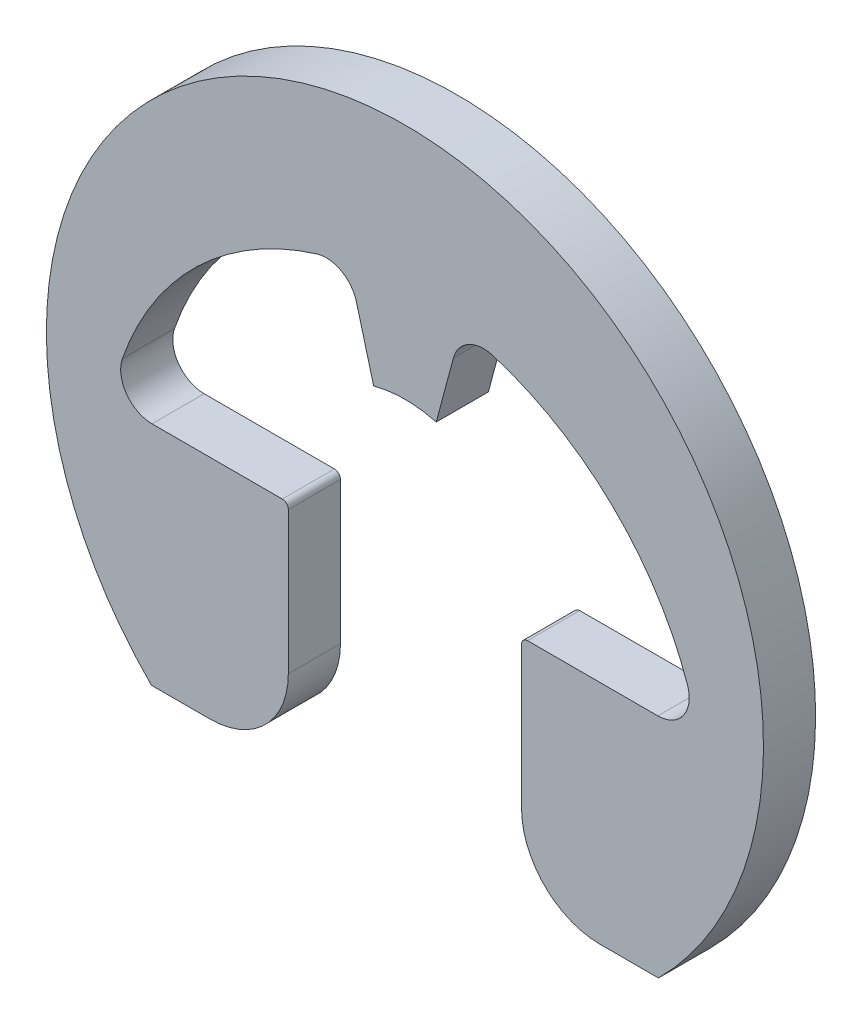
ISO-10303-21;
HEADER;
FILE_DESCRIPTION(('STEP AP214'),'2;1');
FILE_NAME('part.step','',(''),(''),'','','');
FILE_SCHEMA(('AUTOMOTIVE_DESIGN { 1 0 10303 214 1 1 1 1 }'));
ENDSEC;
DATA;
#1=APPLICATION_CONTEXT('core data for automotive mechanical design processes');
#2=APPLICATION_PROTOCOL_DEFINITION('international standard','automotive_design',2000,#1);
#3=PRODUCT_CONTEXT('',#1,'mechanical');
#4=PRODUCT('Part','Part','',(#3));
#5=PRODUCT_RELATED_PRODUCT_CATEGORY('part','',(#4));
#6=PRODUCT_DEFINITION_FORMATION('','',#4);
#7=PRODUCT_DEFINITION_CONTEXT('part definition',#1,'design');
#8=PRODUCT_DEFINITION('design','',#6,#7);
#9=PRODUCT_DEFINITION_SHAPE('','',#8);
#10=(LENGTH_UNIT() NAMED_UNIT(*) SI_UNIT(.MILLI.,.METRE.));
#11=(NAMED_UNIT(*) PLANE_ANGLE_UNIT() SI_UNIT($,.RADIAN.));
#12=(NAMED_UNIT(*) SI_UNIT($,.STERADIAN.) SOLID_ANGLE_UNIT());
#13=UNCERTAINTY_MEASURE_WITH_UNIT(LENGTH_MEASURE(1.E-05),#10,'distance_accuracy_value','');
#14=(GEOMETRIC_REPRESENTATION_CONTEXT(3) GLOBAL_UNCERTAINTY_ASSIGNED_CONTEXT((#13)) GLOBAL_UNIT_ASSIGNED_CONTEXT((#10,
#11,#12)) REPRESENTATION_CONTEXT('',''));
#15=CARTESIAN_POINT('',(0.,0.,0.));
#16=DIRECTION('',(0.,0.,1.));
#17=DIRECTION('',(1.,0.,0.));
#18=AXIS2_PLACEMENT_3D('',#15,#16,#17);
#19=CARTESIAN_POINT('',(-3.08091253639806,0.0553443471143975,-0.635));
#20=DIRECTION('',(0.,0.,1.));
#21=DIRECTION('',(1.,0.,0.));
#22=AXIS2_PLACEMENT_3D('',#19,#20,#21);
#23=CYLINDRICAL_SURFACE('',#22,0.382041175221683);
#24=CARTESIAN_POINT('',(-3.08091253639806,0.0553443471143975,0.));
#25=DIRECTION('',(0.,0.,-1.));
#26=DIRECTION('',(1.,0.,0.));
#27=AXIS2_PLACEMENT_3D('',#24,#25,#26);
#28=CIRCLE('',#27,0.382041175221683);
#29=CARTESIAN_POINT('',(-3.08091253639806,-0.326696828107286,0.));
#30=VERTEX_POINT('',#29);
#31=CARTESIAN_POINT('',(-3.44192060779963,0.180358874061002,0.));
#32=VERTEX_POINT('',#31);
#33=EDGE_CURVE('E208',#30,#32,#28,.T.);
#34=ORIENTED_EDGE('',*,*,#33,.F.);
#35=DIRECTION('',(0.,0.,1.));
#36=VECTOR('',#35,1.);
#37=CARTESIAN_POINT('',(-3.08091253639806,-0.326696828107286,-0.635));
#38=LINE('',#37,#36);
#39=CARTESIAN_POINT('',(-3.08091253639806,-0.326696828107286,-0.635));
#40=VERTEX_POINT('',#39);
#41=EDGE_CURVE('E11',#40,#30,#38,.T.);
#42=ORIENTED_EDGE('',*,*,#41,.F.);
#43=CARTESIAN_POINT('',(-3.08091253639806,0.0553443471143975,-0.635));
#44=DIRECTION('',(0.,0.,-1.));
#45=DIRECTION('',(1.,0.,0.));
#46=AXIS2_PLACEMENT_3D('',#43,#44,#45);
#47=CIRCLE('',#46,0.382041175221683);
#48=CARTESIAN_POINT('',(-3.44192060779963,0.180358874061002,-0.635));
#49=VERTEX_POINT('',#48);
#50=EDGE_CURVE('E264',#40,#49,#47,.T.);
#51=ORIENTED_EDGE('',*,*,#50,.T.);
#52=DIRECTION('',(0.,0.,1.));
#53=VECTOR('',#52,1.);
#54=CARTESIAN_POINT('',(-3.44192060779963,0.180358874061002,-0.635));
#55=LINE('',#54,#53);
#56=EDGE_CURVE('E42',#49,#32,#55,.T.);
#57=ORIENTED_EDGE('',*,*,#56,.T.);
#58=EDGE_LOOP('',(#34,#42,#51,#57));
#59=FACE_BOUND('',#58,.T.);
#60=ADVANCED_FACE('F39',(#59),#23,.F.);
#61=CARTESIAN_POINT('',(-1.49415202365351,-0.326696828107286,-0.635));
#62=DIRECTION('',(0.,1.,0.));
#63=DIRECTION('',(-1.,0.,0.));
#64=AXIS2_PLACEMENT_3D('',#61,#62,#63);
#65=PLANE('',#64);
#66=DIRECTION('',(-1.,0.,0.));
#67=VECTOR('',#66,1.);
#68=CARTESIAN_POINT('',(-1.49415202365351,-0.326696828107286,0.));
#69=LINE('',#68,#67);
#70=CARTESIAN_POINT('',(-1.49415202365351,-0.326696828107286,0.));
#71=VERTEX_POINT('',#70);
#72=EDGE_CURVE('E262',#71,#30,#69,.T.);
#73=ORIENTED_EDGE('',*,*,#72,.F.);
#74=DIRECTION('',(0.,0.,1.));
#75=VECTOR('',#74,1.);
#76=CARTESIAN_POINT('',(-1.49415202365351,-0.326696828107286,-0.635));
#77=LINE('',#76,#75);
#78=CARTESIAN_POINT('',(-1.49415202365351,-0.326696828107286,-0.635));
#79=VERTEX_POINT('',#78);
#80=EDGE_CURVE('E48',#79,#71,#77,.T.);
#81=ORIENTED_EDGE('',*,*,#80,.F.);
#82=DIRECTION('',(-1.,0.,0.));
#83=VECTOR('',#82,1.);
#84=CARTESIAN_POINT('',(-1.49415202365351,-0.326696828107286,-0.635));
#85=LINE('',#84,#83);
#86=EDGE_CURVE('E198',#79,#40,#85,.T.);
#87=ORIENTED_EDGE('',*,*,#86,.T.);
#88=ORIENTED_EDGE('',*,*,#41,.T.);
#89=EDGE_LOOP('',(#73,#81,#87,#88));
#90=FACE_BOUND('',#89,.T.);
#91=ADVANCED_FACE('F300',(#90),#65,.T.);
#92=CARTESIAN_POINT('',(-1.49415202365351,-0.400356828107286,-0.635));
#93=DIRECTION('',(0.,0.,1.));
#94=DIRECTION('',(1.,0.,0.));
#95=AXIS2_PLACEMENT_3D('',#92,#93,#94);
#96=CYLINDRICAL_SURFACE('',#95,0.07366);
#97=CARTESIAN_POINT('',(-1.49415202365351,-0.400356828107286,0.));
#98=DIRECTION('',(0.,0.,1.));
#99=DIRECTION('',(1.,0.,0.));
#100=AXIS2_PLACEMENT_3D('',#97,#98,#99);
#101=CIRCLE('',#100,0.07366);
#102=CARTESIAN_POINT('',(-1.42049202365351,-0.400356828107286,0.));
#103=VERTEX_POINT('',#102);
#104=EDGE_CURVE('E185',#103,#71,#101,.T.);
#105=ORIENTED_EDGE('',*,*,#104,.F.);
#106=DIRECTION('',(0.,0.,1.));
#107=VECTOR('',#106,1.);
#108=CARTESIAN_POINT('',(-1.42049202365351,-0.400356828107286,-0.635));
#109=LINE('',#108,#107);
#110=CARTESIAN_POINT('',(-1.42049202365351,-0.400356828107286,-0.635));
#111=VERTEX_POINT('',#110);
#112=EDGE_CURVE('E180',#111,#103,#109,.T.);
#113=ORIENTED_EDGE('',*,*,#112,.F.);
#114=CARTESIAN_POINT('',(-1.49415202365351,-0.400356828107286,-0.635));
#115=DIRECTION('',(0.,0.,1.));
#116=DIRECTION('',(1.,0.,0.));
#117=AXIS2_PLACEMENT_3D('',#114,#115,#116);
#118=CIRCLE('',#117,0.07366);
#119=EDGE_CURVE('E183',#111,#79,#118,.T.);
#120=ORIENTED_EDGE('',*,*,#119,.T.);
#121=ORIENTED_EDGE('',*,*,#80,.T.);
#122=EDGE_LOOP('',(#105,#113,#120,#121));
#123=FACE_BOUND('',#122,.T.);
#124=ADVANCED_FACE('F182',(#123),#96,.T.);
#125=CARTESIAN_POINT('',(-1.42049202365351,-0.400356828107286,-0.635));
#126=DIRECTION('',(1.,0.,0.));
#127=DIRECTION('',(0.,0.,-1.));
#128=AXIS2_PLACEMENT_3D('',#125,#126,#127);
#129=PLANE('',#128);
#130=DIRECTION('',(0.,1.,0.));
#131=VECTOR('',#130,1.);
#132=CARTESIAN_POINT('',(-1.42049202365351,-0.400356828107286,0.));
#133=LINE('',#132,#131);
#134=CARTESIAN_POINT('',(-1.42049202365351,-2.1331515120763,0.));
#135=VERTEX_POINT('',#134);
#136=EDGE_CURVE('E259',#135,#103,#133,.T.);
#137=ORIENTED_EDGE('',*,*,#136,.F.);
#138=DIRECTION('',(0.,0.,1.));
#139=VECTOR('',#138,1.);
#140=CARTESIAN_POINT('',(-1.42049202365351,-2.1331515120763,-0.635));
#141=LINE('',#140,#139);
#142=CARTESIAN_POINT('',(-1.42049202365351,-2.1331515120763,-0.635));
#143=VERTEX_POINT('',#142);
#144=EDGE_CURVE('E190',#143,#135,#141,.T.);
#145=ORIENTED_EDGE('',*,*,#144,.F.);
#146=DIRECTION('',(0.,1.,0.));
#147=VECTOR('',#146,1.);
#148=CARTESIAN_POINT('',(-1.42049202365351,-0.400356828107286,-0.635));
#149=LINE('',#148,#147);
#150=EDGE_CURVE('E196',#143,#111,#149,.T.);
#151=ORIENTED_EDGE('',*,*,#150,.T.);
#152=ORIENTED_EDGE('',*,*,#112,.T.);
#153=EDGE_LOOP('',(#137,#145,#151,#152));
#154=FACE_BOUND('',#153,.T.);
#155=ADVANCED_FACE('F200',(#154),#129,.T.);
#156=CARTESIAN_POINT('',(-2.37559496170772,-2.1331515120763,-0.635));
#157=DIRECTION('',(0.,0.,1.));
#158=DIRECTION('',(1.,0.,0.));
#159=AXIS2_PLACEMENT_3D('',#156,#157,#158);
#160=CYLINDRICAL_SURFACE('',#159,0.95510293805421);
#161=CARTESIAN_POINT('',(-2.37559496170772,-2.1331515120763,0.));
#162=DIRECTION('',(0.,0.,1.));
#163=DIRECTION('',(1.,0.,0.));
#164=AXIS2_PLACEMENT_3D('',#161,#162,#163);
#165=CIRCLE('',#164,0.95510293805421);
#166=CARTESIAN_POINT('',(-2.37559496170772,-3.08825445013051,0.));
#167=VERTEX_POINT('',#166);
#168=EDGE_CURVE('E256',#167,#135,#165,.T.);
#169=ORIENTED_EDGE('',*,*,#168,.F.);
#170=DIRECTION('',(0.,0.,1.));
#171=VECTOR('',#170,1.);
#172=CARTESIAN_POINT('',(-2.37559496170772,-3.08825445013051,-0.635));
#173=LINE('',#172,#171);
#174=CARTESIAN_POINT('',(-2.37559496170772,-3.08825445013051,-0.635));
#175=VERTEX_POINT('',#174);
#176=EDGE_CURVE('E268',#175,#167,#173,.T.);
#177=ORIENTED_EDGE('',*,*,#176,.F.);
#178=CARTESIAN_POINT('',(-2.37559496170772,-2.1331515120763,-0.635));
#179=DIRECTION('',(0.,0.,1.));
#180=DIRECTION('',(1.,0.,0.));
#181=AXIS2_PLACEMENT_3D('',#178,#179,#180);
#182=CIRCLE('',#181,0.95510293805421);
#183=EDGE_CURVE('E201',#175,#143,#182,.T.);
#184=ORIENTED_EDGE('',*,*,#183,.T.);
#185=ORIENTED_EDGE('',*,*,#144,.T.);
#186=EDGE_LOOP('',(#169,#177,#184,#185));
#187=FACE_BOUND('',#186,.T.);
#188=ADVANCED_FACE('F313',(#187),#160,.T.);
#189=CARTESIAN_POINT('',(-2.37559496170772,-3.08825445013051,-0.635));
#190=DIRECTION('',(0.,-1.,0.));
#191=DIRECTION('',(0.,0.,-1.));
#192=AXIS2_PLACEMENT_3D('',#189,#190,#191);
#193=PLANE('',#192);
#194=DIRECTION('',(1.,0.,0.));
#195=VECTOR('',#194,1.);
#196=CARTESIAN_POINT('',(-2.37559496170772,-3.08825445013051,0.));
#197=LINE('',#196,#195);
#198=CARTESIAN_POINT('',(-3.0882544501305,-3.08825445013051,0.));
#199=VERTEX_POINT('',#198);
#200=EDGE_CURVE('E253',#199,#167,#197,.T.);
#201=ORIENTED_EDGE('',*,*,#200,.F.);
#202=DIRECTION('',(0.,0.,1.));
#203=VECTOR('',#202,1.);
#204=CARTESIAN_POINT('',(-3.0882544501305,-3.08825445013051,-0.635));
#205=LINE('',#204,#203);
#206=CARTESIAN_POINT('',(-3.0882544501305,-3.08825445013051,-0.635));
#207=VERTEX_POINT('',#206);
#208=EDGE_CURVE('E270',#207,#199,#205,.T.);
#209=ORIENTED_EDGE('',*,*,#208,.F.);
#210=DIRECTION('',(1.,0.,0.));
#211=VECTOR('',#210,1.);
#212=CARTESIAN_POINT('',(-2.37559496170772,-3.08825445013051,-0.635));
#213=LINE('',#212,#211);
#214=EDGE_CURVE('E203',#207,#175,#213,.T.);
#215=ORIENTED_EDGE('',*,*,#214,.T.);
#216=ORIENTED_EDGE('',*,*,#176,.T.);
#217=EDGE_LOOP('',(#201,#209,#215,#216));
#218=FACE_BOUND('',#217,.T.);
#219=ADVANCED_FACE('F316',(#218),#193,.T.);
#220=CARTESIAN_POINT('',(0.,0.,-0.635));
#221=DIRECTION('',(0.,0.,1.));
#222=DIRECTION('',(1.,0.,0.));
#223=AXIS2_PLACEMENT_3D('',#220,#221,#222);
#224=CYLINDRICAL_SURFACE('',#223,4.36745132743363);
#225=CARTESIAN_POINT('',(0.,0.,0.));
#226=DIRECTION('',(0.,0.,1.));
#227=DIRECTION('',(1.,0.,0.));
#228=AXIS2_PLACEMENT_3D('',#225,#226,#227);
#229=CIRCLE('',#228,4.36745132743363);
#230=CARTESIAN_POINT('',(3.08825445013051,-3.08825445013051,0.));
#231=VERTEX_POINT('',#230);
#232=EDGE_CURVE('E250',#231,#199,#229,.T.);
#233=ORIENTED_EDGE('',*,*,#232,.F.);
#234=DIRECTION('',(0.,0.,1.));
#235=VECTOR('',#234,1.);
#236=CARTESIAN_POINT('',(3.08825445013051,-3.08825445013051,-0.635));
#237=LINE('',#236,#235);
#238=CARTESIAN_POINT('',(3.08825445013051,-3.08825445013051,-0.635));
#239=VERTEX_POINT('',#238);
#240=EDGE_CURVE('E272',#239,#231,#237,.T.);
#241=ORIENTED_EDGE('',*,*,#240,.F.);
#242=CARTESIAN_POINT('',(0.,0.,-0.635));
#243=DIRECTION('',(0.,0.,1.));
#244=DIRECTION('',(1.,0.,0.));
#245=AXIS2_PLACEMENT_3D('',#242,#243,#244);
#246=CIRCLE('',#245,4.36745132743363);
#247=EDGE_CURVE('E555',#239,#207,#246,.T.);
#248=ORIENTED_EDGE('',*,*,#247,.T.);
#249=ORIENTED_EDGE('',*,*,#208,.T.);
#250=EDGE_LOOP('',(#233,#241,#248,#249));
#251=FACE_BOUND('',#250,.T.);
#252=ADVANCED_FACE('F320',(#251),#224,.T.);
#253=CARTESIAN_POINT('',(3.08825445013051,-3.08825445013051,-0.635));
#254=DIRECTION('',(0.,-1.,0.));
#255=DIRECTION('',(0.,0.,-1.));
#256=AXIS2_PLACEMENT_3D('',#253,#254,#255);
#257=PLANE('',#256);
#258=DIRECTION('',(1.,0.,0.));
#259=VECTOR('',#258,1.);
#260=CARTESIAN_POINT('',(3.08825445013051,-3.08825445013051,0.));
#261=LINE('',#260,#259);
#262=CARTESIAN_POINT('',(2.37559496170772,-3.08825445013051,0.));
#263=VERTEX_POINT('',#262);
#264=EDGE_CURVE('E247',#263,#231,#261,.T.);
#265=ORIENTED_EDGE('',*,*,#264,.F.);
#266=DIRECTION('',(0.,0.,1.));
#267=VECTOR('',#266,1.);
#268=CARTESIAN_POINT('',(2.37559496170772,-3.08825445013051,-0.635));
#269=LINE('',#268,#267);
#270=CARTESIAN_POINT('',(2.37559496170772,-3.08825445013051,-0.635));
#271=VERTEX_POINT('',#270);
#272=EDGE_CURVE('E274',#271,#263,#269,.T.);
#273=ORIENTED_EDGE('',*,*,#272,.F.);
#274=DIRECTION('',(1.,0.,0.));
#275=VECTOR('',#274,1.);
#276=CARTESIAN_POINT('',(3.08825445013051,-3.08825445013051,-0.635));
#277=LINE('',#276,#275);
#278=EDGE_CURVE('E548',#271,#239,#277,.T.);
#279=ORIENTED_EDGE('',*,*,#278,.T.);
#280=ORIENTED_EDGE('',*,*,#240,.T.);
#281=EDGE_LOOP('',(#265,#273,#279,#280));
#282=FACE_BOUND('',#281,.T.);
#283=ADVANCED_FACE('F324',(#282),#257,.T.);
#284=CARTESIAN_POINT('',(2.37559496170772,-2.1331515120763,-0.635));
#285=DIRECTION('',(0.,0.,1.));
#286=DIRECTION('',(1.,0.,0.));
#287=AXIS2_PLACEMENT_3D('',#284,#285,#286);
#288=CYLINDRICAL_SURFACE('',#287,0.95510293805421);
#289=CARTESIAN_POINT('',(2.37559496170772,-2.1331515120763,0.));
#290=DIRECTION('',(0.,0.,1.));
#291=DIRECTION('',(1.,0.,0.));
#292=AXIS2_PLACEMENT_3D('',#289,#290,#291);
#293=CIRCLE('',#292,0.95510293805421);
#294=CARTESIAN_POINT('',(1.42049202365351,-2.1331515120763,0.));
#295=VERTEX_POINT('',#294);
#296=EDGE_CURVE('E244',#295,#263,#293,.T.);
#297=ORIENTED_EDGE('',*,*,#296,.F.);
#298=DIRECTION('',(0.,0.,1.));
#299=VECTOR('',#298,1.);
#300=CARTESIAN_POINT('',(1.42049202365351,-2.1331515120763,-0.635));
#301=LINE('',#300,#299);
#302=CARTESIAN_POINT('',(1.42049202365351,-2.1331515120763,-0.635));
#303=VERTEX_POINT('',#302);
#304=EDGE_CURVE('E276',#303,#295,#301,.T.);
#305=ORIENTED_EDGE('',*,*,#304,.F.);
#306=CARTESIAN_POINT('',(2.37559496170772,-2.1331515120763,-0.635));
#307=DIRECTION('',(0.,0.,1.));
#308=DIRECTION('',(1.,0.,0.));
#309=AXIS2_PLACEMENT_3D('',#306,#307,#308);
#310=CIRCLE('',#309,0.95510293805421);
#311=EDGE_CURVE('E544',#303,#271,#310,.T.);
#312=ORIENTED_EDGE('',*,*,#311,.T.);
#313=ORIENTED_EDGE('',*,*,#272,.T.);
#314=EDGE_LOOP('',(#297,#305,#312,#313));
#315=FACE_BOUND('',#314,.T.);
#316=ADVANCED_FACE('F328',(#315),#288,.T.);
#317=CARTESIAN_POINT('',(1.42049202365351,-0.400356828107286,-0.635));
#318=DIRECTION('',(-1.,0.,0.));
#319=DIRECTION('',(0.,0.,1.));
#320=AXIS2_PLACEMENT_3D('',#317,#318,#319);
#321=PLANE('',#320);
#322=DIRECTION('',(0.,-1.,0.));
#323=VECTOR('',#322,1.);
#324=CARTESIAN_POINT('',(1.42049202365351,-0.400356828107286,0.));
#325=LINE('',#324,#323);
#326=CARTESIAN_POINT('',(1.42049202365351,-0.400356828107286,0.));
#327=VERTEX_POINT('',#326);
#328=EDGE_CURVE('E241',#327,#295,#325,.T.);
#329=ORIENTED_EDGE('',*,*,#328,.F.);
#330=DIRECTION('',(0.,0.,1.));
#331=VECTOR('',#330,1.);
#332=CARTESIAN_POINT('',(1.42049202365351,-0.400356828107286,-0.635));
#333=LINE('',#332,#331);
#334=CARTESIAN_POINT('',(1.42049202365351,-0.400356828107286,-0.635));
#335=VERTEX_POINT('',#334);
#336=EDGE_CURVE('E278',#335,#327,#333,.T.);
#337=ORIENTED_EDGE('',*,*,#336,.F.);
#338=DIRECTION('',(0.,-1.,0.));
#339=VECTOR('',#338,1.);
#340=CARTESIAN_POINT('',(1.42049202365351,-0.400356828107286,-0.635));
#341=LINE('',#340,#339);
#342=EDGE_CURVE('E560',#335,#303,#341,.T.);
#343=ORIENTED_EDGE('',*,*,#342,.T.);
#344=ORIENTED_EDGE('',*,*,#304,.T.);
#345=EDGE_LOOP('',(#329,#337,#343,#344));
#346=FACE_BOUND('',#345,.T.);
#347=ADVANCED_FACE('F332',(#346),#321,.T.);
#348=CARTESIAN_POINT('',(1.49415202365351,-0.400356828107286,-0.635));
#349=DIRECTION('',(0.,0.,1.));
#350=DIRECTION('',(1.,0.,0.));
#351=AXIS2_PLACEMENT_3D('',#348,#349,#350);
#352=CYLINDRICAL_SURFACE('',#351,0.07366);
#353=CARTESIAN_POINT('',(1.49415202365351,-0.400356828107286,0.));
#354=DIRECTION('',(0.,0.,1.));
#355=DIRECTION('',(1.,0.,0.));
#356=AXIS2_PLACEMENT_3D('',#353,#354,#355);
#357=CIRCLE('',#356,0.07366);
#358=CARTESIAN_POINT('',(1.49415202365351,-0.326696828107286,0.));
#359=VERTEX_POINT('',#358);
#360=EDGE_CURVE('E238',#359,#327,#357,.T.);
#361=ORIENTED_EDGE('',*,*,#360,.F.);
#362=DIRECTION('',(0.,0.,1.));
#363=VECTOR('',#362,1.);
#364=CARTESIAN_POINT('',(1.49415202365351,-0.326696828107286,-0.635));
#365=LINE('',#364,#363);
#366=CARTESIAN_POINT('',(1.49415202365351,-0.326696828107286,-0.635));
#367=VERTEX_POINT('',#366);
#368=EDGE_CURVE('E280',#367,#359,#365,.T.);
#369=ORIENTED_EDGE('',*,*,#368,.F.);
#370=CARTESIAN_POINT('',(1.49415202365351,-0.400356828107286,-0.635));
#371=DIRECTION('',(0.,0.,1.));
#372=DIRECTION('',(1.,0.,0.));
#373=AXIS2_PLACEMENT_3D('',#370,#371,#372);
#374=CIRCLE('',#373,0.07366);
#375=EDGE_CURVE('E537',#367,#335,#374,.T.);
#376=ORIENTED_EDGE('',*,*,#375,.T.);
#377=ORIENTED_EDGE('',*,*,#336,.T.);
#378=EDGE_LOOP('',(#361,#369,#376,#377));
#379=FACE_BOUND('',#378,.T.);
#380=ADVANCED_FACE('F336',(#379),#352,.T.);
#381=CARTESIAN_POINT('',(1.49415202365351,-0.326696828107286,-0.635));
#382=DIRECTION('',(0.,1.,0.));
#383=DIRECTION('',(0.,0.,1.));
#384=AXIS2_PLACEMENT_3D('',#381,#382,#383);
#385=PLANE('',#384);
#386=DIRECTION('',(-1.,0.,0.));
#387=VECTOR('',#386,1.);
#388=CARTESIAN_POINT('',(1.49415202365351,-0.326696828107286,0.));
#389=LINE('',#388,#387);
#390=CARTESIAN_POINT('',(3.08091253639806,-0.326696828107286,0.));
#391=VERTEX_POINT('',#390);
#392=EDGE_CURVE('E235',#391,#359,#389,.T.);
#393=ORIENTED_EDGE('',*,*,#392,.F.);
#394=DIRECTION('',(0.,0.,1.));
#395=VECTOR('',#394,1.);
#396=CARTESIAN_POINT('',(3.08091253639806,-0.326696828107286,-0.635));
#397=LINE('',#396,#395);
#398=CARTESIAN_POINT('',(3.08091253639806,-0.326696828107286,-0.635));
#399=VERTEX_POINT('',#398);
#400=EDGE_CURVE('E282',#399,#391,#397,.T.);
#401=ORIENTED_EDGE('',*,*,#400,.F.);
#402=DIRECTION('',(-1.,0.,0.));
#403=VECTOR('',#402,1.);
#404=CARTESIAN_POINT('',(1.49415202365351,-0.326696828107286,-0.635));
#405=LINE('',#404,#403);
#406=EDGE_CURVE('E533',#399,#367,#405,.T.);
#407=ORIENTED_EDGE('',*,*,#406,.T.);
#408=ORIENTED_EDGE('',*,*,#368,.T.);
#409=EDGE_LOOP('',(#393,#401,#407,#408));
#410=FACE_BOUND('',#409,.T.);
#411=ADVANCED_FACE('F340',(#410),#385,.T.);
#412=CARTESIAN_POINT('',(3.08091253639806,0.0553443471143977,-0.635));
#413=DIRECTION('',(0.,0.,1.));
#414=DIRECTION('',(1.,0.,0.));
#415=AXIS2_PLACEMENT_3D('',#412,#413,#414);
#416=CYLINDRICAL_SURFACE('',#415,0.382041175221683);
#417=CARTESIAN_POINT('',(3.08091253639806,0.0553443471143977,0.));
#418=DIRECTION('',(0.,0.,-1.));
#419=DIRECTION('',(1.,0.,0.));
#420=AXIS2_PLACEMENT_3D('',#417,#418,#419);
#421=CIRCLE('',#420,0.382041175221683);
#422=CARTESIAN_POINT('',(3.44192060779963,0.180358874061002,0.));
#423=VERTEX_POINT('',#422);
#424=EDGE_CURVE('E232',#423,#391,#421,.T.);
#425=ORIENTED_EDGE('',*,*,#424,.F.);
#426=DIRECTION('',(0.,0.,1.));
#427=VECTOR('',#426,1.);
#428=CARTESIAN_POINT('',(3.44192060779963,0.180358874061002,-0.635));
#429=LINE('',#428,#427);
#430=CARTESIAN_POINT('',(3.44192060779963,0.180358874061002,-0.635));
#431=VERTEX_POINT('',#430);
#432=EDGE_CURVE('E284',#431,#423,#429,.T.);
#433=ORIENTED_EDGE('',*,*,#432,.F.);
#434=CARTESIAN_POINT('',(3.08091253639806,0.0553443471143977,-0.635));
#435=DIRECTION('',(0.,0.,-1.));
#436=DIRECTION('',(1.,0.,0.));
#437=AXIS2_PLACEMENT_3D('',#434,#435,#436);
#438=CIRCLE('',#437,0.382041175221683);
#439=EDGE_CURVE('E564',#431,#399,#438,.T.);
#440=ORIENTED_EDGE('',*,*,#439,.T.);
#441=ORIENTED_EDGE('',*,*,#400,.T.);
#442=EDGE_LOOP('',(#425,#433,#440,#441));
#443=FACE_BOUND('',#442,.T.);
#444=ADVANCED_FACE('F344',(#443),#416,.F.);
#445=CARTESIAN_POINT('',(0.,-1.01155374689866,-0.635));
#446=DIRECTION('',(0.,0.,1.));
#447=DIRECTION('',(1.,0.,0.));
#448=AXIS2_PLACEMENT_3D('',#445,#446,#447);
#449=CYLINDRICAL_SURFACE('',#448,3.64245427787346);
#450=CARTESIAN_POINT('',(0.,-1.01155374689866,0.));
#451=DIRECTION('',(0.,0.,-1.));
#452=DIRECTION('',(-1.,0.,0.));
#453=AXIS2_PLACEMENT_3D('',#450,#451,#452);
#454=CIRCLE('',#453,3.64245427787346);
#455=CARTESIAN_POINT('',(1.0718385269688,2.46962929030349,0.));
#456=VERTEX_POINT('',#455);
#457=EDGE_CURVE('E229',#456,#423,#454,.T.);
#458=ORIENTED_EDGE('',*,*,#457,.F.);
#459=DIRECTION('',(0.,0.,1.));
#460=VECTOR('',#459,1.);
#461=CARTESIAN_POINT('',(1.0718385269688,2.46962929030349,-0.635));
#462=LINE('',#461,#460);
#463=CARTESIAN_POINT('',(1.0718385269688,2.46962929030349,-0.635));
#464=VERTEX_POINT('',#463);
#465=EDGE_CURVE('E286',#464,#456,#462,.T.);
#466=ORIENTED_EDGE('',*,*,#465,.F.);
#467=CARTESIAN_POINT('',(0.,-1.01155374689866,-0.635));
#468=DIRECTION('',(0.,0.,-1.));
#469=DIRECTION('',(-1.,0.,0.));
#470=AXIS2_PLACEMENT_3D('',#467,#468,#469);
#471=CIRCLE('',#470,3.64245427787346);
#472=EDGE_CURVE('E526',#464,#431,#471,.T.);
#473=ORIENTED_EDGE('',*,*,#472,.T.);
#474=ORIENTED_EDGE('',*,*,#432,.T.);
#475=EDGE_LOOP('',(#458,#466,#473,#474));
#476=FACE_BOUND('',#475,.T.);
#477=ADVANCED_FACE('F348',(#476),#449,.F.);
#478=CARTESIAN_POINT('',(0.959418049111736,2.1045031535738,-0.635));
#479=DIRECTION('',(0.,0.,1.));
#480=DIRECTION('',(1.,0.,0.));
#481=AXIS2_PLACEMENT_3D('',#478,#479,#480);
#482=CYLINDRICAL_SURFACE('',#481,0.382041175221684);
#483=CARTESIAN_POINT('',(0.959418049111736,2.1045031535738,0.));
#484=DIRECTION('',(0.,0.,-1.));
#485=DIRECTION('',(1.,0.,0.));
#486=AXIS2_PLACEMENT_3D('',#483,#484,#485);
#487=CIRCLE('',#486,0.382041175221684);
#488=CARTESIAN_POINT('',(0.590394611259284,2.20338268573452,0.));
#489=VERTEX_POINT('',#488);
#490=EDGE_CURVE('E226',#489,#456,#487,.T.);
#491=ORIENTED_EDGE('',*,*,#490,.F.);
#492=DIRECTION('',(0.,0.,1.));
#493=VECTOR('',#492,1.);
#494=CARTESIAN_POINT('',(0.590394611259284,2.20338268573452,-0.635));
#495=LINE('',#494,#493);
#496=CARTESIAN_POINT('',(0.590394611259284,2.20338268573452,-0.635));
#497=VERTEX_POINT('',#496);
#498=EDGE_CURVE('E288',#497,#489,#495,.T.);
#499=ORIENTED_EDGE('',*,*,#498,.F.);
#500=CARTESIAN_POINT('',(0.959418049111736,2.1045031535738,-0.635));
#501=DIRECTION('',(0.,0.,-1.));
#502=DIRECTION('',(1.,0.,0.));
#503=AXIS2_PLACEMENT_3D('',#500,#501,#502);
#504=CIRCLE('',#503,0.382041175221684);
#505=EDGE_CURVE('E522',#497,#464,#504,.T.);
#506=ORIENTED_EDGE('',*,*,#505,.T.);
#507=ORIENTED_EDGE('',*,*,#465,.T.);
#508=EDGE_LOOP('',(#491,#499,#506,#507));
#509=FACE_BOUND('',#508,.T.);
#510=ADVANCED_FACE('F352',(#509),#482,.F.);
#511=CARTESIAN_POINT('',(0.590394611259284,2.20338268573452,-0.635));
#512=DIRECTION('',(0.965925826289068,-0.258819045102522,0.));
#513=DIRECTION('',(0.258819045102522,0.965925826289068,0.));
#514=AXIS2_PLACEMENT_3D('',#511,#512,#513);
#515=PLANE('',#514);
#516=DIRECTION('',(0.258819045102522,0.965925826289068,0.));
#517=VECTOR('',#516,1.);
#518=CARTESIAN_POINT('',(0.590394611259284,2.20338268573452,0.));
#519=LINE('',#518,#517);
#520=CARTESIAN_POINT('',(0.381292217245035,1.42300192728905,0.));
#521=VERTEX_POINT('',#520);
#522=EDGE_CURVE('E223',#521,#489,#519,.T.);
#523=ORIENTED_EDGE('',*,*,#522,.F.);
#524=DIRECTION('',(0.,0.,1.));
#525=VECTOR('',#524,1.);
#526=CARTESIAN_POINT('',(0.381292217245035,1.42300192728905,-0.635));
#527=LINE('',#526,#525);
#528=CARTESIAN_POINT('',(0.381292217245035,1.42300192728905,-0.635));
#529=VERTEX_POINT('',#528);
#530=EDGE_CURVE('E290',#529,#521,#527,.T.);
#531=ORIENTED_EDGE('',*,*,#530,.F.);
#532=DIRECTION('',(0.258819045102522,0.965925826289068,0.));
#533=VECTOR('',#532,1.);
#534=CARTESIAN_POINT('',(0.590394611259284,2.20338268573452,-0.635));
#535=LINE('',#534,#533);
#536=EDGE_CURVE('E568',#529,#497,#535,.T.);
#537=ORIENTED_EDGE('',*,*,#536,.T.);
#538=ORIENTED_EDGE('',*,*,#498,.T.);
#539=EDGE_LOOP('',(#523,#531,#537,#538));
#540=FACE_BOUND('',#539,.T.);
#541=ADVANCED_FACE('F356',(#540),#515,.T.);
#542=CARTESIAN_POINT('',(0.,0.,-0.635));
#543=DIRECTION('',(0.,0.,1.));
#544=DIRECTION('',(1.,0.,0.));
#545=AXIS2_PLACEMENT_3D('',#542,#543,#544);
#546=CYLINDRICAL_SURFACE('',#545,1.4732);
#547=CARTESIAN_POINT('',(0.,0.,0.));
#548=DIRECTION('',(0.,0.,-1.));
#549=DIRECTION('',(-1.,0.,0.));
#550=AXIS2_PLACEMENT_3D('',#547,#548,#549);
#551=CIRCLE('',#550,1.4732);
#552=CARTESIAN_POINT('',(-0.381292217245035,1.42300192728905,0.));
#553=VERTEX_POINT('',#552);
#554=EDGE_CURVE('E220',#553,#521,#551,.T.);
#555=ORIENTED_EDGE('',*,*,#554,.F.);
#556=DIRECTION('',(0.,0.,1.));
#557=VECTOR('',#556,1.);
#558=CARTESIAN_POINT('',(-0.381292217245035,1.42300192728905,-0.635));
#559=LINE('',#558,#557);
#560=CARTESIAN_POINT('',(-0.381292217245035,1.42300192728905,-0.635));
#561=VERTEX_POINT('',#560);
#562=EDGE_CURVE('E292',#561,#553,#559,.T.);
#563=ORIENTED_EDGE('',*,*,#562,.F.);
#564=CARTESIAN_POINT('',(0.,0.,-0.635));
#565=DIRECTION('',(0.,0.,-1.));
#566=DIRECTION('',(-1.,0.,0.));
#567=AXIS2_PLACEMENT_3D('',#564,#565,#566);
#568=CIRCLE('',#567,1.4732);
#569=EDGE_CURVE('E515',#561,#529,#568,.T.);
#570=ORIENTED_EDGE('',*,*,#569,.T.);
#571=ORIENTED_EDGE('',*,*,#530,.T.);
#572=EDGE_LOOP('',(#555,#563,#570,#571));
#573=FACE_BOUND('',#572,.T.);
#574=ADVANCED_FACE('F360',(#573),#546,.F.);
#575=CARTESIAN_POINT('',(-0.590394611259284,2.20338268573452,-0.635));
#576=DIRECTION('',(-0.965925826289068,-0.258819045102522,0.));
#577=DIRECTION('',(0.258819045102522,-0.965925826289068,0.));
#578=AXIS2_PLACEMENT_3D('',#575,#576,#577);
#579=PLANE('',#578);
#580=DIRECTION('',(0.258819045102522,-0.965925826289068,0.));
#581=VECTOR('',#580,1.);
#582=CARTESIAN_POINT('',(-0.590394611259284,2.20338268573452,0.));
#583=LINE('',#582,#581);
#584=CARTESIAN_POINT('',(-0.590394611259284,2.20338268573452,0.));
#585=VERTEX_POINT('',#584);
#586=EDGE_CURVE('E217',#585,#553,#583,.T.);
#587=ORIENTED_EDGE('',*,*,#586,.F.);
#588=DIRECTION('',(0.,0.,1.));
#589=VECTOR('',#588,1.);
#590=CARTESIAN_POINT('',(-0.590394611259284,2.20338268573452,-0.635));
#591=LINE('',#590,#589);
#592=CARTESIAN_POINT('',(-0.590394611259284,2.20338268573452,-0.635));
#593=VERTEX_POINT('',#592);
#594=EDGE_CURVE('E294',#593,#585,#591,.T.);
#595=ORIENTED_EDGE('',*,*,#594,.F.);
#596=DIRECTION('',(0.258819045102522,-0.965925826289068,0.));
#597=VECTOR('',#596,1.);
#598=CARTESIAN_POINT('',(-0.590394611259284,2.20338268573452,-0.635));
#599=LINE('',#598,#597);
#600=EDGE_CURVE('E511',#593,#561,#599,.T.);
#601=ORIENTED_EDGE('',*,*,#600,.T.);
#602=ORIENTED_EDGE('',*,*,#562,.T.);
#603=EDGE_LOOP('',(#587,#595,#601,#602));
#604=FACE_BOUND('',#603,.T.);
#605=ADVANCED_FACE('F364',(#604),#579,.T.);
#606=CARTESIAN_POINT('',(-0.959418049111736,2.1045031535738,-0.635));
#607=DIRECTION('',(0.,0.,1.));
#608=DIRECTION('',(1.,0.,0.));
#609=AXIS2_PLACEMENT_3D('',#606,#607,#608);
#610=CYLINDRICAL_SURFACE('',#609,0.382041175221684);
#611=CARTESIAN_POINT('',(-0.959418049111736,2.1045031535738,0.));
#612=DIRECTION('',(0.,0.,-1.));
#613=DIRECTION('',(1.,0.,0.));
#614=AXIS2_PLACEMENT_3D('',#611,#612,#613);
#615=CIRCLE('',#614,0.382041175221684);
#616=CARTESIAN_POINT('',(-1.0718385269688,2.46962929030349,0.));
#617=VERTEX_POINT('',#616);
#618=EDGE_CURVE('E214',#617,#585,#615,.T.);
#619=ORIENTED_EDGE('',*,*,#618,.F.);
#620=DIRECTION('',(0.,0.,1.));
#621=VECTOR('',#620,1.);
#622=CARTESIAN_POINT('',(-1.0718385269688,2.46962929030349,-0.635));
#623=LINE('',#622,#621);
#624=CARTESIAN_POINT('',(-1.0718385269688,2.46962929030349,-0.635));
#625=VERTEX_POINT('',#624);
#626=EDGE_CURVE('E295',#625,#617,#623,.T.);
#627=ORIENTED_EDGE('',*,*,#626,.F.);
#628=CARTESIAN_POINT('',(-0.959418049111736,2.1045031535738,-0.635));
#629=DIRECTION('',(0.,0.,-1.));
#630=DIRECTION('',(1.,0.,0.));
#631=AXIS2_PLACEMENT_3D('',#628,#629,#630);
#632=CIRCLE('',#631,0.382041175221684);
#633=EDGE_CURVE('E572',#625,#593,#632,.T.);
#634=ORIENTED_EDGE('',*,*,#633,.T.);
#635=ORIENTED_EDGE('',*,*,#594,.T.);
#636=EDGE_LOOP('',(#619,#627,#634,#635));
#637=FACE_BOUND('',#636,.T.);
#638=ADVANCED_FACE('F368',(#637),#610,.F.);
#639=CARTESIAN_POINT('',(0.,-1.01155374689866,-0.635));
#640=DIRECTION('',(0.,0.,1.));
#641=DIRECTION('',(1.,0.,0.));
#642=AXIS2_PLACEMENT_3D('',#639,#640,#641);
#643=CYLINDRICAL_SURFACE('',#642,3.64245427787346);
#644=CARTESIAN_POINT('',(0.,-1.01155374689866,0.));
#645=DIRECTION('',(0.,0.,-1.));
#646=DIRECTION('',(-1.,0.,0.));
#647=AXIS2_PLACEMENT_3D('',#644,#645,#646);
#648=CIRCLE('',#647,3.64245427787346);
#649=EDGE_CURVE('E211',#32,#617,#648,.T.);
#650=ORIENTED_EDGE('',*,*,#649,.F.);
#651=ORIENTED_EDGE('',*,*,#56,.F.);
#652=CARTESIAN_POINT('',(0.,-1.01155374689866,-0.635));
#653=DIRECTION('',(0.,0.,-1.));
#654=DIRECTION('',(-1.,0.,0.));
#655=AXIS2_PLACEMENT_3D('',#652,#653,#654);
#656=CIRCLE('',#655,3.64245427787346);
#657=EDGE_CURVE('E574',#49,#625,#656,.T.);
#658=ORIENTED_EDGE('',*,*,#657,.T.);
#659=ORIENTED_EDGE('',*,*,#626,.T.);
#660=EDGE_LOOP('',(#650,#651,#658,#659));
#661=FACE_BOUND('',#660,.T.);
#662=ADVANCED_FACE('F297',(#661),#643,.F.);
#663=CARTESIAN_POINT('',(-3.08091253639806,0.0553443471143975,-0.635));
#664=DIRECTION('',(0.,0.,1.));
#665=DIRECTION('',(1.,0.,0.));
#666=AXIS2_PLACEMENT_3D('',#663,#664,#665);
#667=PLANE('',#666);
#668=ORIENTED_EDGE('',*,*,#50,.F.);
#669=ORIENTED_EDGE('',*,*,#86,.F.);
#670=ORIENTED_EDGE('',*,*,#119,.F.);
#671=ORIENTED_EDGE('',*,*,#150,.F.);
#672=ORIENTED_EDGE('',*,*,#183,.F.);
#673=ORIENTED_EDGE('',*,*,#214,.F.);
#674=ORIENTED_EDGE('',*,*,#247,.F.);
#675=ORIENTED_EDGE('',*,*,#278,.F.);
#676=ORIENTED_EDGE('',*,*,#311,.F.);
#677=ORIENTED_EDGE('',*,*,#342,.F.);
#678=ORIENTED_EDGE('',*,*,#375,.F.);
#679=ORIENTED_EDGE('',*,*,#406,.F.);
#680=ORIENTED_EDGE('',*,*,#439,.F.);
#681=ORIENTED_EDGE('',*,*,#472,.F.);
#682=ORIENTED_EDGE('',*,*,#505,.F.);
#683=ORIENTED_EDGE('',*,*,#536,.F.);
#684=ORIENTED_EDGE('',*,*,#569,.F.);
#685=ORIENTED_EDGE('',*,*,#600,.F.);
#686=ORIENTED_EDGE('',*,*,#633,.F.);
#687=ORIENTED_EDGE('',*,*,#657,.F.);
#688=EDGE_LOOP('',(#668,#669,#670,#671,#672,#673,#674,#675,#676,#677,#678,#679,#680,#681,#682,
#683,#684,#685,#686,#687));
#689=FACE_BOUND('',#688,.T.);
#690=ADVANCED_FACE('F194',(#689),#667,.F.);
#691=CARTESIAN_POINT('',(-3.08091253639806,0.0553443471143975,0.));
#692=DIRECTION('',(0.,0.,1.));
#693=DIRECTION('',(1.,0.,0.));
#694=AXIS2_PLACEMENT_3D('',#691,#692,#693);
#695=PLANE('',#694);
#696=ORIENTED_EDGE('',*,*,#33,.T.);
#697=ORIENTED_EDGE('',*,*,#649,.T.);
#698=ORIENTED_EDGE('',*,*,#618,.T.);
#699=ORIENTED_EDGE('',*,*,#586,.T.);
#700=ORIENTED_EDGE('',*,*,#554,.T.);
#701=ORIENTED_EDGE('',*,*,#522,.T.);
#702=ORIENTED_EDGE('',*,*,#490,.T.);
#703=ORIENTED_EDGE('',*,*,#457,.T.);
#704=ORIENTED_EDGE('',*,*,#424,.T.);
#705=ORIENTED_EDGE('',*,*,#392,.T.);
#706=ORIENTED_EDGE('',*,*,#360,.T.);
#707=ORIENTED_EDGE('',*,*,#328,.T.);
#708=ORIENTED_EDGE('',*,*,#296,.T.);
#709=ORIENTED_EDGE('',*,*,#264,.T.);
#710=ORIENTED_EDGE('',*,*,#232,.T.);
#711=ORIENTED_EDGE('',*,*,#200,.T.);
#712=ORIENTED_EDGE('',*,*,#168,.T.);
#713=ORIENTED_EDGE('',*,*,#136,.T.);
#714=ORIENTED_EDGE('',*,*,#104,.T.);
#715=ORIENTED_EDGE('',*,*,#72,.T.);
#716=EDGE_LOOP('',(#696,#697,#698,#699,#700,#701,#702,#703,#704,#705,#706,#707,#708,#709,#710,
#711,#712,#713,#714,#715));
#717=FACE_BOUND('',#716,.T.);
#718=ADVANCED_FACE('F299',(#717),#695,.T.);
#719=CLOSED_SHELL('',(#60,#91,#124,#155,#188,#219,#252,#283,#316,#347,#380,#411,#444,#477,#510,
#541,#574,#605,#638,#662,#690,#718));
#720=MANIFOLD_SOLID_BREP('B2',#719);
#721=ADVANCED_BREP_SHAPE_REPRESENTATION('',(#18,#720),#14);
#722=SHAPE_DEFINITION_REPRESENTATION(#9,#721);
ENDSEC;
END-ISO-10303-21;
